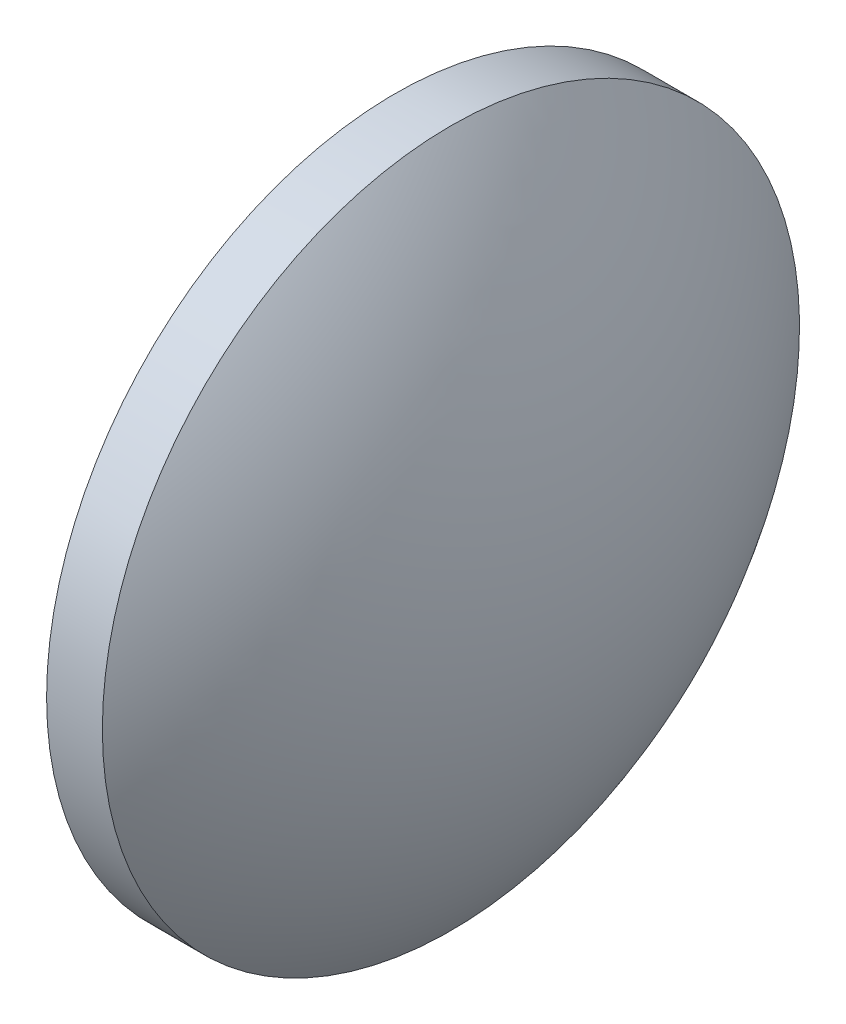
ISO-10303-21;
HEADER;
FILE_DESCRIPTION(('STEP AP214'),'2;1');
FILE_NAME('part.step','',(''),(''),'','','');
FILE_SCHEMA(('AUTOMOTIVE_DESIGN { 1 0 10303 214 1 1 1 1 }'));
ENDSEC;
DATA;
#1=APPLICATION_CONTEXT('core data for automotive mechanical design processes');
#2=APPLICATION_PROTOCOL_DEFINITION('international standard','automotive_design',2000,#1);
#3=PRODUCT_CONTEXT('',#1,'mechanical');
#4=PRODUCT('Part','Part','',(#3));
#5=PRODUCT_RELATED_PRODUCT_CATEGORY('part','',(#4));
#6=PRODUCT_DEFINITION_FORMATION('','',#4);
#7=PRODUCT_DEFINITION_CONTEXT('part definition',#1,'design');
#8=PRODUCT_DEFINITION('design','',#6,#7);
#9=PRODUCT_DEFINITION_SHAPE('','',#8);
#10=(LENGTH_UNIT() NAMED_UNIT(*) SI_UNIT(.MILLI.,.METRE.));
#11=(NAMED_UNIT(*) PLANE_ANGLE_UNIT() SI_UNIT($,.RADIAN.));
#12=(NAMED_UNIT(*) SI_UNIT($,.STERADIAN.) SOLID_ANGLE_UNIT());
#13=UNCERTAINTY_MEASURE_WITH_UNIT(LENGTH_MEASURE(1.E-05),#10,'distance_accuracy_value','');
#14=(GEOMETRIC_REPRESENTATION_CONTEXT(3) GLOBAL_UNCERTAINTY_ASSIGNED_CONTEXT((#13)) GLOBAL_UNIT_ASSIGNED_CONTEXT((#10,
#11,#12)) REPRESENTATION_CONTEXT('',''));
#15=CARTESIAN_POINT('',(0.,0.,0.));
#16=DIRECTION('',(0.,0.,1.));
#17=DIRECTION('',(1.,0.,0.));
#18=AXIS2_PLACEMENT_3D('',#15,#16,#17);
#19=CARTESIAN_POINT('',(549.101581788495,156.072440308979,0.));
#20=DIRECTION('',(-1.,0.,0.));
#21=DIRECTION('',(0.,1.,0.));
#22=AXIS2_PLACEMENT_3D('',#19,#20,#21);
#23=SPHERICAL_SURFACE('',#22,20.6620071258908);
#24=CARTESIAN_POINT('',(565.553588914386,156.072440308979,0.));
#25=DIRECTION('',(-1.,0.,0.));
#26=DIRECTION('',(0.,0.,1.));
#27=AXIS2_PLACEMENT_3D('',#24,#25,#26);
#28=CIRCLE('',#27,12.5);
#29=CARTESIAN_POINT('',(565.553588914386,156.072440308979,12.5));
#30=VERTEX_POINT('',#29);
#31=EDGE_CURVE('E10',#30,#30,#28,.T.);
#32=ORIENTED_EDGE('',*,*,#31,.F.);
#33=EDGE_LOOP('',(#32));
#34=FACE_BOUND('',#33,.T.);
#35=ADVANCED_FACE('F33',(#34),#23,.T.);
#36=CARTESIAN_POINT('',(562.041557672496,156.072440308979,0.));
#37=DIRECTION('',(-1.,0.,0.));
#38=DIRECTION('',(0.,0.,1.));
#39=AXIS2_PLACEMENT_3D('',#36,#37,#38);
#40=CYLINDRICAL_SURFACE('',#39,12.5);
#41=CARTESIAN_POINT('',(563.553588914386,156.072440308979,0.));
#42=DIRECTION('',(-1.,0.,0.));
#43=DIRECTION('',(0.,0.,1.));
#44=AXIS2_PLACEMENT_3D('',#41,#42,#43);
#45=CIRCLE('',#44,12.5);
#46=CARTESIAN_POINT('',(563.553588914386,156.072440308979,12.5));
#47=VERTEX_POINT('',#46);
#48=EDGE_CURVE('E39',#47,#47,#45,.T.);
#49=ORIENTED_EDGE('',*,*,#48,.F.);
#50=EDGE_LOOP('',(#49));
#51=FACE_BOUND('',#50,.T.);
#52=ORIENTED_EDGE('',*,*,#31,.T.);
#53=EDGE_LOOP('',(#52));
#54=FACE_BOUND('',#53,.T.);
#55=ADVANCED_FACE('F47',(#51,#54),#40,.T.);
#56=CARTESIAN_POINT('',(563.553588914386,156.072440308979,0.));
#57=DIRECTION('',(1.,0.,0.));
#58=DIRECTION('',(0.,0.,-1.));
#59=AXIS2_PLACEMENT_3D('',#56,#57,#58);
#60=PLANE('',#59);
#61=ORIENTED_EDGE('',*,*,#48,.T.);
#62=EDGE_LOOP('',(#61));
#63=FACE_BOUND('',#62,.T.);
#64=ADVANCED_FACE('F45',(#63),#60,.F.);
#65=CLOSED_SHELL('',(#35,#55,#64));
#66=MANIFOLD_SOLID_BREP('B2',#65);
#67=ADVANCED_BREP_SHAPE_REPRESENTATION('',(#18,#66),#14);
#68=SHAPE_DEFINITION_REPRESENTATION(#9,#67);
ENDSEC;
END-ISO-10303-21;
